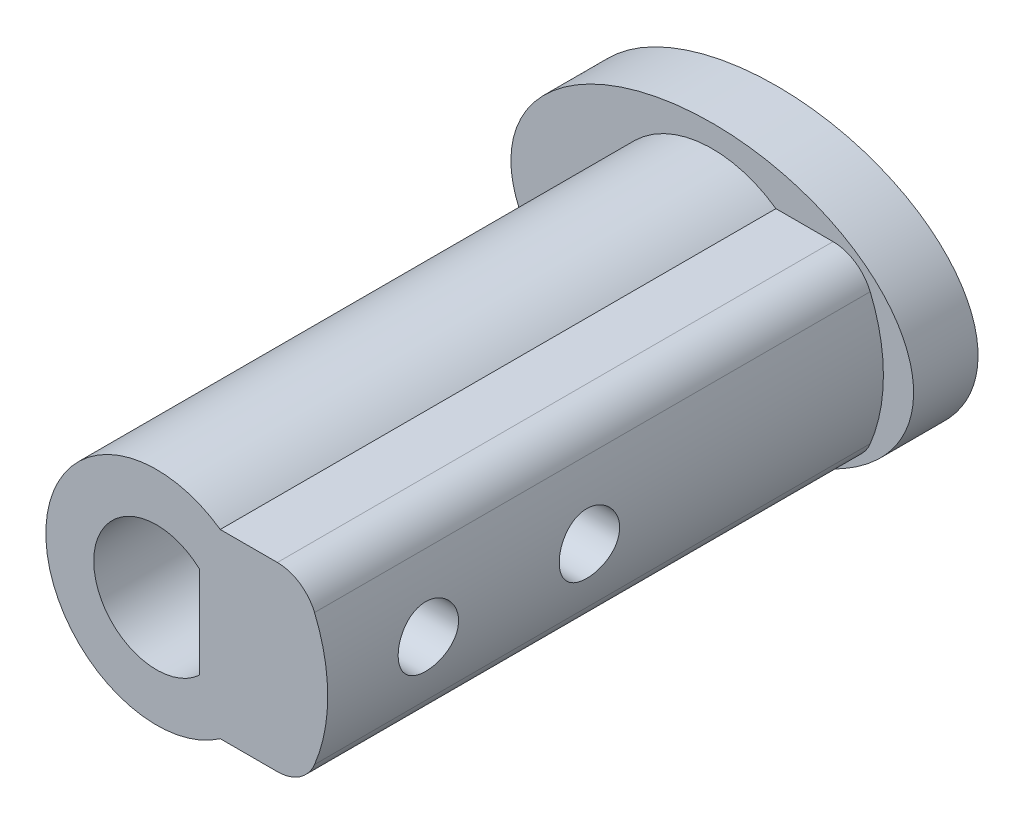
ISO-10303-21;
HEADER;
FILE_DESCRIPTION(('STEP AP214'),'2;1');
FILE_NAME('part.step','',(''),(''),'','','');
FILE_SCHEMA(('AUTOMOTIVE_DESIGN { 1 0 10303 214 1 1 1 1 }'));
ENDSEC;
DATA;
#1=APPLICATION_CONTEXT('core data for automotive mechanical design processes');
#2=APPLICATION_PROTOCOL_DEFINITION('international standard','automotive_design',2000,#1);
#3=PRODUCT_CONTEXT('',#1,'mechanical');
#4=PRODUCT('Part','Part','',(#3));
#5=PRODUCT_RELATED_PRODUCT_CATEGORY('part','',(#4));
#6=PRODUCT_DEFINITION_FORMATION('','',#4);
#7=PRODUCT_DEFINITION_CONTEXT('part definition',#1,'design');
#8=PRODUCT_DEFINITION('design','',#6,#7);
#9=PRODUCT_DEFINITION_SHAPE('','',#8);
#10=(LENGTH_UNIT() NAMED_UNIT(*) SI_UNIT(.MILLI.,.METRE.));
#11=(NAMED_UNIT(*) PLANE_ANGLE_UNIT() SI_UNIT($,.RADIAN.));
#12=(NAMED_UNIT(*) SI_UNIT($,.STERADIAN.) SOLID_ANGLE_UNIT());
#13=UNCERTAINTY_MEASURE_WITH_UNIT(LENGTH_MEASURE(1.E-05),#10,'distance_accuracy_value','');
#14=(GEOMETRIC_REPRESENTATION_CONTEXT(3) GLOBAL_UNCERTAINTY_ASSIGNED_CONTEXT((#13)) GLOBAL_UNIT_ASSIGNED_CONTEXT((#10,
#11,#12)) REPRESENTATION_CONTEXT('',''));
#15=CARTESIAN_POINT('',(0.,0.,0.));
#16=DIRECTION('',(0.,0.,1.));
#17=DIRECTION('',(1.,0.,0.));
#18=AXIS2_PLACEMENT_3D('',#15,#16,#17);
#19=CARTESIAN_POINT('',(0.,0.,13.8));
#20=DIRECTION('',(0.,0.,1.));
#21=DIRECTION('',(1.,0.,0.));
#22=AXIS2_PLACEMENT_3D('',#19,#20,#21);
#23=PLANE('',#22);
#24=DIRECTION('',(0.,1.,0.));
#25=VECTOR('',#24,1.);
#26=CARTESIAN_POINT('',(1.06,1.14455231422596,13.8));
#27=LINE('',#26,#25);
#28=CARTESIAN_POINT('',(1.06,-1.14455231422596,13.8));
#29=VERTEX_POINT('',#28);
#30=CARTESIAN_POINT('',(1.06,1.14455231422596,13.8));
#31=VERTEX_POINT('',#30);
#32=EDGE_CURVE('E71',#29,#31,#27,.T.);
#33=ORIENTED_EDGE('',*,*,#32,.F.);
#34=CARTESIAN_POINT('',(0.,0.,13.8));
#35=DIRECTION('',(0.,0.,1.));
#36=DIRECTION('',(1.,0.,0.));
#37=AXIS2_PLACEMENT_3D('',#34,#35,#36);
#38=CIRCLE('',#37,1.56);
#39=EDGE_CURVE('E130',#31,#29,#38,.T.);
#40=ORIENTED_EDGE('',*,*,#39,.F.);
#41=EDGE_LOOP('',(#33,#40));
#42=FACE_BOUND('',#41,.T.);
#43=DIRECTION('',(-1.,0.,0.));
#44=VECTOR('',#43,1.);
#45=CARTESIAN_POINT('',(0.,-2.25,13.8));
#46=LINE('',#45,#44);
#47=CARTESIAN_POINT('',(3.,-2.25,13.8));
#48=VERTEX_POINT('',#47);
#49=CARTESIAN_POINT('',(1.58113883008419,-2.25,13.8));
#50=VERTEX_POINT('',#49);
#51=EDGE_CURVE('E252',#48,#50,#46,.T.);
#52=ORIENTED_EDGE('',*,*,#51,.F.);
#53=CARTESIAN_POINT('',(3.,-1.25,13.8));
#54=DIRECTION('',(0.,0.,1.));
#55=DIRECTION('',(1.,0.,0.));
#56=AXIS2_PLACEMENT_3D('',#53,#54,#55);
#57=CIRCLE('',#56,1.);
#58=CARTESIAN_POINT('',(3.92307692307692,-1.63461538461538,13.8));
#59=VERTEX_POINT('',#58);
#60=EDGE_CURVE('E228',#48,#59,#57,.T.);
#61=ORIENTED_EDGE('',*,*,#60,.T.);
#62=CARTESIAN_POINT('',(0.,0.,13.8));
#63=DIRECTION('',(0.,0.,1.));
#64=DIRECTION('',(1.,0.,0.));
#65=AXIS2_PLACEMENT_3D('',#62,#63,#64);
#66=CIRCLE('',#65,4.25);
#67=CARTESIAN_POINT('',(3.92307692307692,1.63461538461538,13.8));
#68=VERTEX_POINT('',#67);
#69=EDGE_CURVE('E179',#59,#68,#66,.T.);
#70=ORIENTED_EDGE('',*,*,#69,.T.);
#71=CARTESIAN_POINT('',(3.,1.25,13.8));
#72=DIRECTION('',(0.,0.,1.));
#73=DIRECTION('',(1.,0.,0.));
#74=AXIS2_PLACEMENT_3D('',#71,#72,#73);
#75=CIRCLE('',#74,1.);
#76=CARTESIAN_POINT('',(3.,2.25,13.8));
#77=VERTEX_POINT('',#76);
#78=EDGE_CURVE('E229',#68,#77,#75,.T.);
#79=ORIENTED_EDGE('',*,*,#78,.T.);
#80=DIRECTION('',(-1.,0.,0.));
#81=VECTOR('',#80,1.);
#82=CARTESIAN_POINT('',(0.,2.25,13.8));
#83=LINE('',#82,#81);
#84=CARTESIAN_POINT('',(1.58113883008419,2.25,13.8));
#85=VERTEX_POINT('',#84);
#86=EDGE_CURVE('E262',#77,#85,#83,.T.);
#87=ORIENTED_EDGE('',*,*,#86,.T.);
#88=CARTESIAN_POINT('',(0.,0.,13.8));
#89=DIRECTION('',(0.,0.,1.));
#90=DIRECTION('',(1.,0.,0.));
#91=AXIS2_PLACEMENT_3D('',#88,#89,#90);
#92=CIRCLE('',#91,2.75);
#93=EDGE_CURVE('E246',#85,#50,#92,.T.);
#94=ORIENTED_EDGE('',*,*,#93,.T.);
#95=EDGE_LOOP('',(#52,#61,#70,#79,#87,#94));
#96=FACE_BOUND('',#95,.T.);
#97=ADVANCED_FACE('F55',(#42,#96),#23,.T.);
#98=CARTESIAN_POINT('',(0.,2.25,13.8));
#99=DIRECTION('',(0.,-1.,0.));
#100=DIRECTION('',(0.,0.,-1.));
#101=AXIS2_PLACEMENT_3D('',#98,#99,#100);
#102=PLANE('',#101);
#103=ORIENTED_EDGE('',*,*,#86,.F.);
#104=DIRECTION('',(0.,0.,-1.));
#105=VECTOR('',#104,1.);
#106=CARTESIAN_POINT('',(3.,2.25,13.8));
#107=LINE('',#106,#105);
#108=CARTESIAN_POINT('',(3.,2.25,0.));
#109=VERTEX_POINT('',#108);
#110=EDGE_CURVE('E238',#77,#109,#107,.T.);
#111=ORIENTED_EDGE('',*,*,#110,.T.);
#112=DIRECTION('',(-1.,0.,0.));
#113=VECTOR('',#112,1.);
#114=CARTESIAN_POINT('',(0.,2.25,0.));
#115=LINE('',#114,#113);
#116=CARTESIAN_POINT('',(1.58113883008419,2.25,0.));
#117=VERTEX_POINT('',#116);
#118=EDGE_CURVE('E224',#109,#117,#115,.T.);
#119=ORIENTED_EDGE('',*,*,#118,.T.);
#120=DIRECTION('',(0.,0.,-1.));
#121=VECTOR('',#120,1.);
#122=CARTESIAN_POINT('',(1.58113883008419,2.25,13.8));
#123=LINE('',#122,#121);
#124=EDGE_CURVE('E255',#85,#117,#123,.T.);
#125=ORIENTED_EDGE('',*,*,#124,.F.);
#126=EDGE_LOOP('',(#103,#111,#119,#125));
#127=FACE_BOUND('',#126,.T.);
#128=ADVANCED_FACE('F189',(#127),#102,.F.);
#129=CARTESIAN_POINT('',(0.,-2.25,13.8));
#130=DIRECTION('',(0.,-1.,0.));
#131=DIRECTION('',(0.,0.,-1.));
#132=AXIS2_PLACEMENT_3D('',#129,#130,#131);
#133=PLANE('',#132);
#134=DIRECTION('',(-1.,0.,0.));
#135=VECTOR('',#134,1.);
#136=CARTESIAN_POINT('',(0.,-2.25,0.));
#137=LINE('',#136,#135);
#138=CARTESIAN_POINT('',(3.,-2.25,0.));
#139=VERTEX_POINT('',#138);
#140=CARTESIAN_POINT('',(1.58113883008419,-2.25,0.));
#141=VERTEX_POINT('',#140);
#142=EDGE_CURVE('E216',#139,#141,#137,.T.);
#143=ORIENTED_EDGE('',*,*,#142,.F.);
#144=DIRECTION('',(0.,0.,1.));
#145=VECTOR('',#144,1.);
#146=CARTESIAN_POINT('',(3.,-2.25,13.8));
#147=LINE('',#146,#145);
#148=EDGE_CURVE('E218',#139,#48,#147,.T.);
#149=ORIENTED_EDGE('',*,*,#148,.T.);
#150=ORIENTED_EDGE('',*,*,#51,.T.);
#151=DIRECTION('',(0.,0.,-1.));
#152=VECTOR('',#151,1.);
#153=CARTESIAN_POINT('',(1.58113883008419,-2.25,13.8));
#154=LINE('',#153,#152);
#155=EDGE_CURVE('E221',#50,#141,#154,.T.);
#156=ORIENTED_EDGE('',*,*,#155,.T.);
#157=EDGE_LOOP('',(#143,#149,#150,#156));
#158=FACE_BOUND('',#157,.T.);
#159=ADVANCED_FACE('F187',(#158),#133,.T.);
#160=CARTESIAN_POINT('',(0.,0.,13.8));
#161=DIRECTION('',(0.,0.,-1.));
#162=DIRECTION('',(-1.,0.,0.));
#163=AXIS2_PLACEMENT_3D('',#160,#161,#162);
#164=CYLINDRICAL_SURFACE('',#163,4.25);
#165=CARTESIAN_POINT('',(4.25,0.,10.55));
#166=CARTESIAN_POINT('',(4.24999926232906,-0.0417801036558417,10.5500016410655));
#167=CARTESIAN_POINT('',(4.24937752218848,-0.0835820854495831,10.5535029499502));
#168=CARTESIAN_POINT('',(4.24695717273913,-0.16601110233646,10.5674083965709));
#169=CARTESIAN_POINT('',(4.24515752183303,-0.206637064271769,10.5778186438239));
#170=CARTESIAN_POINT('',(4.2405829590259,-0.28550975502663,10.6052157566467));
#171=CARTESIAN_POINT('',(4.23780888317352,-0.323758490481054,10.6221969856328));
#172=CARTESIAN_POINT('',(4.23158953081535,-0.39685965027986,10.6622386886377));
#173=CARTESIAN_POINT('',(4.22814432077395,-0.431712410425308,10.6852985607503));
#174=CARTESIAN_POINT('',(4.22092278237271,-0.497408258274775,10.7371043354236));
#175=CARTESIAN_POINT('',(4.21714360614304,-0.528209876681436,10.7659024345124));
#176=CARTESIAN_POINT('',(4.20970156508019,-0.584570632531849,10.8282548648953));
#177=CARTESIAN_POINT('',(4.2060387080512,-0.610129418843638,10.8618095144991));
#178=CARTESIAN_POINT('',(4.19921641337439,-0.655448076121172,10.9330111973356));
#179=CARTESIAN_POINT('',(4.19606065244577,-0.675166398644268,10.9706850585941));
#180=CARTESIAN_POINT('',(4.19064966689049,-0.707978576351588,11.0488754715234));
#181=CARTESIAN_POINT('',(4.18839437382125,-0.721072935029005,11.0893918068686));
#182=CARTESIAN_POINT('',(4.18506818060967,-0.740133703294526,11.1716755284485));
#183=CARTESIAN_POINT('',(4.18398533611756,-0.746172047357436,11.2134257591264));
#184=CARTESIAN_POINT('',(4.18309057064614,-0.75117252743079,11.2973597555259));
#185=CARTESIAN_POINT('',(4.18327854881353,-0.75013522496901,11.3395434865793));
#186=CARTESIAN_POINT('',(4.18489329766313,-0.741072329396011,11.422630066272));
#187=CARTESIAN_POINT('',(4.18630566365241,-0.733127993089627,11.4635420991887));
#188=CARTESIAN_POINT('',(4.19018746722882,-0.710604264366118,11.543443365905));
#189=CARTESIAN_POINT('',(4.19265694505036,-0.696024619403205,11.5824325264558));
#190=CARTESIAN_POINT('',(4.19839005614253,-0.66056309072688,11.6576220301013));
#191=CARTESIAN_POINT('',(4.20165786944088,-0.639647891501165,11.6938063287921));
#192=CARTESIAN_POINT('',(4.20861661439201,-0.592132570812258,11.762182510342));
#193=CARTESIAN_POINT('',(4.21230758420846,-0.565531936403415,11.7943740325544));
#194=CARTESIAN_POINT('',(4.21975981830548,-0.506960222014234,11.8543208232901));
#195=CARTESIAN_POINT('',(4.2235213457719,-0.474919521613591,11.8820080806479));
#196=CARTESIAN_POINT('',(4.23064348840692,-0.40661150852387,11.9316240888768));
#197=CARTESIAN_POINT('',(4.23400410037794,-0.370344162128984,11.9535527938213));
#198=CARTESIAN_POINT('',(4.23995141707324,-0.29454521674882,11.9910371493343));
#199=CARTESIAN_POINT('',(4.24253733251073,-0.255010340648913,12.0065863061233));
#200=CARTESIAN_POINT('',(4.24663767600577,-0.173834241190264,12.0308044983209));
#201=CARTESIAN_POINT('',(4.24815220470439,-0.132193216067157,12.0394741799646));
#202=CARTESIAN_POINT('',(4.24992546288406,-0.0485725558095839,12.0495939992918));
#203=CARTESIAN_POINT('',(4.25020041716811,-0.00660454218075324,12.051137419203));
#204=CARTESIAN_POINT('',(4.24950815832121,0.0769901356257715,12.0472102935282));
#205=CARTESIAN_POINT('',(4.24854099899416,0.118616814510258,12.041740051749));
#206=CARTESIAN_POINT('',(4.24548325347931,0.200055524270153,12.0240184613299));
#207=CARTESIAN_POINT('',(4.24340039830497,0.239878021478904,12.0118137605856));
#208=CARTESIAN_POINT('',(4.23834383527136,0.316911666540892,11.9810197697941));
#209=CARTESIAN_POINT('',(4.23537007247744,0.354122653189888,11.9624300860292));
#210=CARTESIAN_POINT('',(4.22882116347154,0.425278959676642,11.9191834639318));
#211=CARTESIAN_POINT('',(4.22524040769843,0.459188690438286,11.8944688350162));
#212=CARTESIAN_POINT('',(4.21789043127108,0.522412876883492,11.83975264383));
#213=CARTESIAN_POINT('',(4.21412119517438,0.551726955222171,11.8097506478476));
#214=CARTESIAN_POINT('',(4.20676598389818,0.605277478758793,11.7448911555741));
#215=CARTESIAN_POINT('',(4.20318266418919,0.629450601649747,11.7099810281203));
#216=CARTESIAN_POINT('',(4.19665631142218,0.671589438245797,11.6365407830835));
#217=CARTESIAN_POINT('',(4.19371325636983,0.689555365192545,11.5980107899151));
#218=CARTESIAN_POINT('',(4.18882100286901,0.718677351182494,11.5185941409196));
#219=CARTESIAN_POINT('',(4.18686737764035,0.729863787189205,11.4777189095037));
#220=CARTESIAN_POINT('',(4.18416451565379,0.745204023492612,11.3946318826126));
#221=CARTESIAN_POINT('',(4.1834151601336,0.749358517265351,11.3524202193518));
#222=CARTESIAN_POINT('',(4.18321121922775,0.750495820755532,11.2684917376012));
#223=CARTESIAN_POINT('',(4.18373862278374,0.74757839230588,11.2267762815984));
#224=CARTESIAN_POINT('',(4.18598908972288,0.734871614368317,11.144440026429));
#225=CARTESIAN_POINT('',(4.18771214781508,0.725082295289569,11.1038192224191));
#226=CARTESIAN_POINT('',(4.19215259279266,0.698949633335143,11.0248708272738));
#227=CARTESIAN_POINT('',(4.19486852210688,0.682615894548754,10.9865399698953));
#228=CARTESIAN_POINT('',(4.2009899182803,0.64386857614485,10.913146565259));
#229=CARTESIAN_POINT('',(4.20439542604978,0.621454635783343,10.8780842120906));
#230=CARTESIAN_POINT('',(4.2115688260778,0.570831308323749,10.8117210117007));
#231=CARTESIAN_POINT('',(4.21534093189969,0.542548878313247,10.7804763299391));
#232=CARTESIAN_POINT('',(4.22278986653214,0.481144741699562,10.7231426357581));
#233=CARTESIAN_POINT('',(4.2264666732178,0.448021922979752,10.6970548114159));
#234=CARTESIAN_POINT('',(4.23334435655226,0.377567199324346,10.650586328036));
#235=CARTESIAN_POINT('',(4.23654127457447,0.340204321815142,10.6302520320145));
#236=CARTESIAN_POINT('',(4.24206044179995,0.262550145066849,10.5961806933688));
#237=CARTESIAN_POINT('',(4.24438353917235,0.222261731048774,10.5824372497884));
#238=CARTESIAN_POINT('',(4.24740147616006,0.151527970272479,10.5648334543557));
#239=CARTESIAN_POINT('',(4.2483705808961,0.121504265501447,10.559280086802));
#240=CARTESIAN_POINT('',(4.24967010546265,0.0609909207886144,10.5518627988371));
#241=CARTESIAN_POINT('',(4.25000053853183,0.0305012905179232,10.5499988019509));
#242=CARTESIAN_POINT('',(4.25,0.,10.55));
#243=B_SPLINE_CURVE_WITH_KNOTS('',3,(#165,#166,#167,#168,#169,#170,#171,#172,#173,#174,#175,
#176,#177,#178,#179,#180,#181,#182,#183,#184,#185,#186,#187,#188,#189,#190,#191,#192,#193,#194,
#195,#196,#197,#198,#199,#200,#201,#202,#203,#204,#205,#206,#207,#208,#209,#210,#211,#212,#213,
#214,#215,#216,#217,#218,#219,#220,#221,#222,#223,#224,#225,#226,#227,#228,#229,#230,#231,#232,
#233,#234,#235,#236,#237,#238,#239,#240,#241,#242),.UNSPECIFIED.,.T.,.F.,(4,2,2,2,2,2,2,2,2,2,2,
2,2,2,2,2,2,2,2,2,2,2,2,2,2,2,2,2,2,2,2,2,2,2,2,2,2,2,4),(0.,0.125228795632619,
0.250568477870663,0.375800881310456,0.501020888917449,0.627436701173604,0.753860977204517,
0.881164136709624,1.00845761833749,1.13444172585883,1.26041583531821,1.38492769201763,
1.50944428814618,1.63462736898626,1.75982174874027,1.8867593244378,2.01369791248091,
2.14076539339061,2.26782093658993,2.39320852686428,2.51859068598222,2.64311506295635,
2.76764711986626,2.89339995869702,3.01916311757835,3.14639554927612,3.27362360960354,
3.40027729936533,3.52691849806632,3.65178362296406,3.77664819531808,3.90133019323914,
4.02601959027724,4.15236563621662,4.27874075690808,4.40610697542581,4.53334924564149,
4.62477360126061,4.71619606177588),.UNSPECIFIED.);
#244=CARTESIAN_POINT('',(4.25,0.,10.55));
#245=VERTEX_POINT('',#244);
#246=EDGE_CURVE('E168',#245,#245,#243,.T.);
#247=ORIENTED_EDGE('',*,*,#246,.T.);
#248=EDGE_LOOP('',(#247));
#249=FACE_BOUND('',#248,.T.);
#250=CARTESIAN_POINT('',(4.25,0.,6.55));
#251=CARTESIAN_POINT('',(4.24999926232906,-0.0417801036558417,6.55000164106545));
#252=CARTESIAN_POINT('',(4.24937752218848,-0.083582085449583,6.55350294995021));
#253=CARTESIAN_POINT('',(4.24695717273913,-0.16601110233646,6.56740839657088));
#254=CARTESIAN_POINT('',(4.24515752183303,-0.206637064271769,6.57781864382395));
#255=CARTESIAN_POINT('',(4.2405829590259,-0.28550975502663,6.60521575664666));
#256=CARTESIAN_POINT('',(4.23780888317352,-0.323758490481054,6.62219698563282));
#257=CARTESIAN_POINT('',(4.23158953081535,-0.39685965027986,6.66223868863767));
#258=CARTESIAN_POINT('',(4.22814432077395,-0.431712410425308,6.68529856075031));
#259=CARTESIAN_POINT('',(4.22092278237271,-0.497408258274774,6.73710433542363));
#260=CARTESIAN_POINT('',(4.21714360614304,-0.528209876681435,6.76590243451238));
#261=CARTESIAN_POINT('',(4.20970156508019,-0.584570632531849,6.82825486489534));
#262=CARTESIAN_POINT('',(4.2060387080512,-0.610129418843638,6.86180951449909));
#263=CARTESIAN_POINT('',(4.19921641337439,-0.655448076121171,6.93301119733562));
#264=CARTESIAN_POINT('',(4.19606065244577,-0.675166398644267,6.97068505859406));
#265=CARTESIAN_POINT('',(4.19064966689049,-0.707978576351586,7.04887547152335));
#266=CARTESIAN_POINT('',(4.18839437382125,-0.721072935029004,7.08939180686864));
#267=CARTESIAN_POINT('',(4.18506818060967,-0.740133703294525,7.17167552844854));
#268=CARTESIAN_POINT('',(4.18398533611756,-0.746172047357434,7.21342575912645));
#269=CARTESIAN_POINT('',(4.18309057064614,-0.751172527430789,7.29735975552588));
#270=CARTESIAN_POINT('',(4.18327854881353,-0.750135224969008,7.33954348657926));
#271=CARTESIAN_POINT('',(4.18489329766313,-0.74107232939601,7.42263006627202));
#272=CARTESIAN_POINT('',(4.18630566365241,-0.733127993089627,7.46354209918867));
#273=CARTESIAN_POINT('',(4.19018746722882,-0.710604264366117,7.54344336590499));
#274=CARTESIAN_POINT('',(4.19265694505036,-0.696024619403204,7.58243252645582));
#275=CARTESIAN_POINT('',(4.19839005614253,-0.660563090726879,7.65762203010133));
#276=CARTESIAN_POINT('',(4.20165786944088,-0.639647891501163,7.69380632879214));
#277=CARTESIAN_POINT('',(4.20861661439201,-0.592132570812257,7.762182510342));
#278=CARTESIAN_POINT('',(4.21230758420846,-0.565531936403414,7.79437403255435));
#279=CARTESIAN_POINT('',(4.21975981830548,-0.506960222014233,7.85432082329008));
#280=CARTESIAN_POINT('',(4.2235213457719,-0.47491952161359,7.88200808064788));
#281=CARTESIAN_POINT('',(4.23064348840692,-0.406611508523869,7.93162408887682));
#282=CARTESIAN_POINT('',(4.23400410037794,-0.370344162128984,7.95355279382128));
#283=CARTESIAN_POINT('',(4.23995141707324,-0.294545216748819,7.99103714933434));
#284=CARTESIAN_POINT('',(4.24253733251073,-0.255010340648912,8.00658630612332));
#285=CARTESIAN_POINT('',(4.24663767600577,-0.173834241190264,8.03080449832094));
#286=CARTESIAN_POINT('',(4.24815220470439,-0.132193216067158,8.03947417996462));
#287=CARTESIAN_POINT('',(4.24992546288406,-0.0485725558095844,8.04959399929182));
#288=CARTESIAN_POINT('',(4.25020041716811,-0.00660454218075368,8.05113741920298));
#289=CARTESIAN_POINT('',(4.24950815832121,0.0769901356257712,8.04721029352824));
#290=CARTESIAN_POINT('',(4.24854099899416,0.118616814510258,8.04174005174896));
#291=CARTESIAN_POINT('',(4.24548325347931,0.200055524270153,8.02401846132994));
#292=CARTESIAN_POINT('',(4.24340039830497,0.239878021478904,8.01181376058558));
#293=CARTESIAN_POINT('',(4.23834383527136,0.316911666540891,7.9810197697941));
#294=CARTESIAN_POINT('',(4.23537007247744,0.354122653189888,7.96243008602924));
#295=CARTESIAN_POINT('',(4.22882116347154,0.425278959676643,7.91918346393175));
#296=CARTESIAN_POINT('',(4.22524040769843,0.459188690438286,7.89446883501617));
#297=CARTESIAN_POINT('',(4.21789043127108,0.522412876883492,7.83975264382997));
#298=CARTESIAN_POINT('',(4.21412119517438,0.551726955222171,7.80975064784757));
#299=CARTESIAN_POINT('',(4.20676598389818,0.605277478758792,7.74489115557414));
#300=CARTESIAN_POINT('',(4.20318266418919,0.629450601649746,7.70998102812031));
#301=CARTESIAN_POINT('',(4.19665631142218,0.671589438245796,7.63654078308354));
#302=CARTESIAN_POINT('',(4.19371325636983,0.689555365192544,7.59801078991513));
#303=CARTESIAN_POINT('',(4.18882100286901,0.718677351182493,7.51859414091957));
#304=CARTESIAN_POINT('',(4.18686737764035,0.729863787189204,7.47771890950373));
#305=CARTESIAN_POINT('',(4.18416451565379,0.745204023492612,7.39463188261258));
#306=CARTESIAN_POINT('',(4.1834151601336,0.74935851726535,7.35242021935179));
#307=CARTESIAN_POINT('',(4.18321121922775,0.750495820755531,7.26849173760115));
#308=CARTESIAN_POINT('',(4.18373862278374,0.747578392305879,7.22677628159839));
#309=CARTESIAN_POINT('',(4.18598908972288,0.734871614368316,7.14444002642897));
#310=CARTESIAN_POINT('',(4.18771214781508,0.725082295289568,7.10381922241913));
#311=CARTESIAN_POINT('',(4.19215259279266,0.698949633335142,7.02487082727384));
#312=CARTESIAN_POINT('',(4.19486852210689,0.682615894548753,6.98653996989528));
#313=CARTESIAN_POINT('',(4.2009899182803,0.64386857614485,6.91314656525901));
#314=CARTESIAN_POINT('',(4.20439542604978,0.621454635783343,6.87808421209058));
#315=CARTESIAN_POINT('',(4.2115688260778,0.570831308323749,6.81172101170074));
#316=CARTESIAN_POINT('',(4.21534093189969,0.542548878313247,6.78047632993915));
#317=CARTESIAN_POINT('',(4.22278986653214,0.481144741699561,6.72314263575812));
#318=CARTESIAN_POINT('',(4.22646667321781,0.448021922979751,6.69705481141588));
#319=CARTESIAN_POINT('',(4.23334435655226,0.377567199324345,6.65058632803605));
#320=CARTESIAN_POINT('',(4.23654127457447,0.340204321815141,6.63025203201454));
#321=CARTESIAN_POINT('',(4.24206044179995,0.262550145066849,6.59618069336885));
#322=CARTESIAN_POINT('',(4.24438353917235,0.222261731048773,6.58243724978842));
#323=CARTESIAN_POINT('',(4.24740147616006,0.151527970272478,6.56483345435568));
#324=CARTESIAN_POINT('',(4.2483705808961,0.121504265501446,6.55928008680204));
#325=CARTESIAN_POINT('',(4.24967010546265,0.0609909207886137,6.55186279883711));
#326=CARTESIAN_POINT('',(4.25000053853183,0.0305012905179228,6.54999880195094));
#327=CARTESIAN_POINT('',(4.25,0.,6.55));
#328=B_SPLINE_CURVE_WITH_KNOTS('',3,(#250,#251,#252,#253,#254,#255,#256,#257,#258,#259,#260,
#261,#262,#263,#264,#265,#266,#267,#268,#269,#270,#271,#272,#273,#274,#275,#276,#277,#278,#279,
#280,#281,#282,#283,#284,#285,#286,#287,#288,#289,#290,#291,#292,#293,#294,#295,#296,#297,#298,
#299,#300,#301,#302,#303,#304,#305,#306,#307,#308,#309,#310,#311,#312,#313,#314,#315,#316,#317,
#318,#319,#320,#321,#322,#323,#324,#325,#326,#327),.UNSPECIFIED.,.T.,.F.,(4,2,2,2,2,2,2,2,2,2,2,
2,2,2,2,2,2,2,2,2,2,2,2,2,2,2,2,2,2,2,2,2,2,2,2,2,2,2,4),(0.,0.125228795632619,
0.250568477870662,0.375800881310456,0.501020888917449,0.627436701173603,0.753860977204518,
0.881164136709621,1.00845761833749,1.13444172585883,1.26041583531821,1.38492769201763,
1.50944428814618,1.63462736898626,1.75982174874027,1.8867593244378,2.0136979124809,
2.14076539339061,2.26782093658992,2.39320852686427,2.51859068598222,2.64311506295635,
2.76764711986626,2.89339995869702,3.01916311757835,3.14639554927611,3.27362360960354,
3.40027729936533,3.52691849806632,3.65178362296406,3.77664819531808,3.90133019323913,
4.02601959027723,4.15236563621661,4.27874075690808,4.4061069754258,4.53334924564149,
4.62477360126061,4.71619606177588),.UNSPECIFIED.);
#329=CARTESIAN_POINT('',(4.25,0.,6.55));
#330=VERTEX_POINT('',#329);
#331=EDGE_CURVE('E148',#330,#330,#328,.T.);
#332=ORIENTED_EDGE('',*,*,#331,.T.);
#333=EDGE_LOOP('',(#332));
#334=FACE_BOUND('',#333,.T.);
#335=ORIENTED_EDGE('',*,*,#69,.F.);
#336=DIRECTION('',(0.,0.,-1.));
#337=VECTOR('',#336,1.);
#338=CARTESIAN_POINT('',(3.92307692307692,-1.63461538461538,13.8));
#339=LINE('',#338,#337);
#340=CARTESIAN_POINT('',(3.92307692307692,-1.63461538461538,0.));
#341=VERTEX_POINT('',#340);
#342=EDGE_CURVE('E230',#59,#341,#339,.T.);
#343=ORIENTED_EDGE('',*,*,#342,.T.);
#344=CARTESIAN_POINT('',(0.,0.,0.));
#345=DIRECTION('',(0.,0.,1.));
#346=DIRECTION('',(1.,0.,0.));
#347=AXIS2_PLACEMENT_3D('',#344,#345,#346);
#348=CIRCLE('',#347,4.25);
#349=CARTESIAN_POINT('',(3.92307692307692,1.63461538461538,0.));
#350=VERTEX_POINT('',#349);
#351=EDGE_CURVE('E243',#341,#350,#348,.T.);
#352=ORIENTED_EDGE('',*,*,#351,.T.);
#353=DIRECTION('',(0.,0.,-1.));
#354=VECTOR('',#353,1.);
#355=CARTESIAN_POINT('',(3.92307692307692,1.63461538461538,13.8));
#356=LINE('',#355,#354);
#357=EDGE_CURVE('E233',#350,#68,#356,.F.);
#358=ORIENTED_EDGE('',*,*,#357,.T.);
#359=EDGE_LOOP('',(#335,#343,#352,#358));
#360=FACE_BOUND('',#359,.T.);
#361=ADVANCED_FACE('F181',(#249,#334,#360),#164,.T.);
#362=CARTESIAN_POINT('',(0.,0.,13.8));
#363=DIRECTION('',(0.,0.,-1.));
#364=DIRECTION('',(-1.,0.,0.));
#365=AXIS2_PLACEMENT_3D('',#362,#363,#364);
#366=CYLINDRICAL_SURFACE('',#365,2.75);
#367=ORIENTED_EDGE('',*,*,#93,.F.);
#368=ORIENTED_EDGE('',*,*,#124,.T.);
#369=CARTESIAN_POINT('',(0.,0.,0.));
#370=DIRECTION('',(0.,0.,1.));
#371=DIRECTION('',(1.,0.,0.));
#372=AXIS2_PLACEMENT_3D('',#369,#370,#371);
#373=CIRCLE('',#372,2.75);
#374=EDGE_CURVE('E175',#117,#141,#373,.T.);
#375=ORIENTED_EDGE('',*,*,#374,.T.);
#376=ORIENTED_EDGE('',*,*,#155,.F.);
#377=EDGE_LOOP('',(#367,#368,#375,#376));
#378=FACE_BOUND('',#377,.T.);
#379=ADVANCED_FACE('F186',(#378),#366,.T.);
#380=CARTESIAN_POINT('',(-0.249999999999999,0.,7.3));
#381=DIRECTION('',(1.,0.,0.));
#382=DIRECTION('',(0.,0.,-1.));
#383=AXIS2_PLACEMENT_3D('',#380,#381,#382);
#384=CYLINDRICAL_SURFACE('',#383,0.749999999999999);
#385=CARTESIAN_POINT('',(1.06,0.,7.3));
#386=DIRECTION('',(1.,0.,0.));
#387=DIRECTION('',(0.,1.,0.));
#388=AXIS2_PLACEMENT_3D('',#385,#386,#387);
#389=CIRCLE('',#388,0.749999999999999);
#390=CARTESIAN_POINT('',(1.06,0.749999999999999,7.3));
#391=VERTEX_POINT('',#390);
#392=EDGE_CURVE('E140',#391,#391,#389,.F.);
#393=ORIENTED_EDGE('',*,*,#392,.T.);
#394=EDGE_LOOP('',(#393));
#395=FACE_BOUND('',#394,.T.);
#396=ORIENTED_EDGE('',*,*,#331,.F.);
#397=EDGE_LOOP('',(#396));
#398=FACE_BOUND('',#397,.T.);
#399=ADVANCED_FACE('F163',(#395,#398),#384,.F.);
#400=CARTESIAN_POINT('',(-0.249999999999999,0.,11.3));
#401=DIRECTION('',(1.,0.,0.));
#402=DIRECTION('',(0.,0.,-1.));
#403=AXIS2_PLACEMENT_3D('',#400,#401,#402);
#404=CYLINDRICAL_SURFACE('',#403,0.75);
#405=CARTESIAN_POINT('',(1.06,0.,11.3));
#406=DIRECTION('',(1.,0.,0.));
#407=DIRECTION('',(0.,1.,0.));
#408=AXIS2_PLACEMENT_3D('',#405,#406,#407);
#409=CIRCLE('',#408,0.75);
#410=CARTESIAN_POINT('',(1.06,0.75,11.3));
#411=VERTEX_POINT('',#410);
#412=EDGE_CURVE('E59',#411,#411,#409,.F.);
#413=ORIENTED_EDGE('',*,*,#412,.T.);
#414=EDGE_LOOP('',(#413));
#415=FACE_BOUND('',#414,.T.);
#416=ORIENTED_EDGE('',*,*,#246,.F.);
#417=EDGE_LOOP('',(#416));
#418=FACE_BOUND('',#417,.T.);
#419=ADVANCED_FACE('F156',(#415,#418),#404,.F.);
#420=CARTESIAN_POINT('',(0.,0.,-1.6));
#421=DIRECTION('',(0.,0.,-1.));
#422=DIRECTION('',(-1.,0.,0.));
#423=AXIS2_PLACEMENT_3D('',#420,#421,#422);
#424=ELLIPSE('',#423,5.,3.3);
#425=DIRECTION('',(0.,0.,1.));
#426=VECTOR('',#425,1.);
#427=SURFACE_OF_LINEAR_EXTRUSION('',#424,#426);
#428=CARTESIAN_POINT('',(-5.,0.,-1.6));
#429=VERTEX_POINT('',#428);
#430=EDGE_CURVE('E144',#429,#429,#424,.T.);
#431=ORIENTED_EDGE('',*,*,#430,.F.);
#432=EDGE_LOOP('',(#431));
#433=FACE_BOUND('',#432,.T.);
#434=CARTESIAN_POINT('',(0.,0.,0.));
#435=DIRECTION('',(0.,0.,-1.));
#436=DIRECTION('',(-1.,0.,0.));
#437=AXIS2_PLACEMENT_3D('',#434,#435,#436);
#438=ELLIPSE('',#437,5.,3.3);
#439=CARTESIAN_POINT('',(-5.,0.,0.));
#440=VERTEX_POINT('',#439);
#441=EDGE_CURVE('E143',#440,#440,#438,.T.);
#442=ORIENTED_EDGE('',*,*,#441,.T.);
#443=EDGE_LOOP('',(#442));
#444=FACE_BOUND('',#443,.T.);
#445=ADVANCED_FACE('F151',(#433,#444),#427,.F.);
#446=CARTESIAN_POINT('',(0.,0.,-1.6));
#447=DIRECTION('',(0.,0.,-1.));
#448=DIRECTION('',(-1.,0.,0.));
#449=AXIS2_PLACEMENT_3D('',#446,#447,#448);
#450=PLANE('',#449);
#451=ORIENTED_EDGE('',*,*,#430,.T.);
#452=EDGE_LOOP('',(#451));
#453=FACE_BOUND('',#452,.T.);
#454=ADVANCED_FACE('F155',(#453),#450,.T.);
#455=CARTESIAN_POINT('',(0.,0.,0.));
#456=DIRECTION('',(0.,0.,-1.));
#457=DIRECTION('',(-1.,0.,0.));
#458=AXIS2_PLACEMENT_3D('',#455,#456,#457);
#459=PLANE('',#458);
#460=ORIENTED_EDGE('',*,*,#351,.F.);
#461=CARTESIAN_POINT('',(3.,-1.25,0.));
#462=DIRECTION('',(0.,0.,-1.));
#463=DIRECTION('',(-1.,0.,0.));
#464=AXIS2_PLACEMENT_3D('',#461,#462,#463);
#465=CIRCLE('',#464,1.);
#466=EDGE_CURVE('E64',#341,#139,#465,.T.);
#467=ORIENTED_EDGE('',*,*,#466,.T.);
#468=ORIENTED_EDGE('',*,*,#142,.T.);
#469=ORIENTED_EDGE('',*,*,#374,.F.);
#470=ORIENTED_EDGE('',*,*,#118,.F.);
#471=CARTESIAN_POINT('',(3.,1.25,0.));
#472=DIRECTION('',(0.,0.,-1.));
#473=DIRECTION('',(-1.,0.,0.));
#474=AXIS2_PLACEMENT_3D('',#471,#472,#473);
#475=CIRCLE('',#474,1.);
#476=EDGE_CURVE('E12',#109,#350,#475,.T.);
#477=ORIENTED_EDGE('',*,*,#476,.T.);
#478=EDGE_LOOP('',(#460,#467,#468,#469,#470,#477));
#479=FACE_BOUND('',#478,.T.);
#480=ORIENTED_EDGE('',*,*,#441,.F.);
#481=EDGE_LOOP('',(#480));
#482=FACE_BOUND('',#481,.T.);
#483=ADVANCED_FACE('F158',(#479,#482),#459,.F.);
#484=CARTESIAN_POINT('',(3.,-1.25,13.8));
#485=DIRECTION('',(0.,0.,-1.));
#486=DIRECTION('',(-1.,0.,0.));
#487=AXIS2_PLACEMENT_3D('',#484,#485,#486);
#488=CYLINDRICAL_SURFACE('',#487,1.);
#489=ORIENTED_EDGE('',*,*,#60,.F.);
#490=ORIENTED_EDGE('',*,*,#148,.F.);
#491=ORIENTED_EDGE('',*,*,#466,.F.);
#492=ORIENTED_EDGE('',*,*,#342,.F.);
#493=EDGE_LOOP('',(#489,#490,#491,#492));
#494=FACE_BOUND('',#493,.T.);
#495=ADVANCED_FACE('F194',(#494),#488,.T.);
#496=CARTESIAN_POINT('',(3.,1.25,13.8));
#497=DIRECTION('',(0.,0.,-1.));
#498=DIRECTION('',(-1.,0.,0.));
#499=AXIS2_PLACEMENT_3D('',#496,#497,#498);
#500=CYLINDRICAL_SURFACE('',#499,1.);
#501=ORIENTED_EDGE('',*,*,#78,.F.);
#502=ORIENTED_EDGE('',*,*,#357,.F.);
#503=ORIENTED_EDGE('',*,*,#476,.F.);
#504=ORIENTED_EDGE('',*,*,#110,.F.);
#505=EDGE_LOOP('',(#501,#502,#503,#504));
#506=FACE_BOUND('',#505,.T.);
#507=ADVANCED_FACE('F57',(#506),#500,.T.);
#508=CARTESIAN_POINT('',(1.06,1.14455231422596,1.42583750937693));
#509=DIRECTION('',(1.,0.,0.));
#510=DIRECTION('',(0.,1.,0.));
#511=AXIS2_PLACEMENT_3D('',#508,#509,#510);
#512=PLANE('',#511);
#513=ORIENTED_EDGE('',*,*,#412,.F.);
#514=EDGE_LOOP('',(#513));
#515=FACE_BOUND('',#514,.T.);
#516=DIRECTION('',(0.,-1.,0.));
#517=VECTOR('',#516,1.);
#518=CARTESIAN_POINT('',(1.06,1.14455231422596,5.5));
#519=LINE('',#518,#517);
#520=CARTESIAN_POINT('',(1.06,1.14455231422596,5.5));
#521=VERTEX_POINT('',#520);
#522=CARTESIAN_POINT('',(1.06,-1.14455231422596,5.5));
#523=VERTEX_POINT('',#522);
#524=EDGE_CURVE('E124',#521,#523,#519,.T.);
#525=ORIENTED_EDGE('',*,*,#524,.T.);
#526=DIRECTION('',(0.,0.,1.));
#527=VECTOR('',#526,1.);
#528=CARTESIAN_POINT('',(1.06,-1.14455231422596,1.42583750937693));
#529=LINE('',#528,#527);
#530=EDGE_CURVE('E119',#523,#29,#529,.T.);
#531=ORIENTED_EDGE('',*,*,#530,.T.);
#532=ORIENTED_EDGE('',*,*,#32,.T.);
#533=DIRECTION('',(0.,0.,1.));
#534=VECTOR('',#533,1.);
#535=CARTESIAN_POINT('',(1.06,1.14455231422596,1.42583750937693));
#536=LINE('',#535,#534);
#537=EDGE_CURVE('E127',#521,#31,#536,.T.);
#538=ORIENTED_EDGE('',*,*,#537,.F.);
#539=EDGE_LOOP('',(#525,#531,#532,#538));
#540=FACE_BOUND('',#539,.T.);
#541=ORIENTED_EDGE('',*,*,#392,.F.);
#542=EDGE_LOOP('',(#541));
#543=FACE_BOUND('',#542,.T.);
#544=ADVANCED_FACE('F121',(#515,#540,#543),#512,.F.);
#545=CARTESIAN_POINT('',(0.,0.,1.42583750937693));
#546=DIRECTION('',(0.,0.,1.));
#547=DIRECTION('',(1.,0.,0.));
#548=AXIS2_PLACEMENT_3D('',#545,#546,#547);
#549=CYLINDRICAL_SURFACE('',#548,1.56);
#550=CARTESIAN_POINT('',(0.,0.,5.5));
#551=DIRECTION('',(0.,0.,1.));
#552=DIRECTION('',(1.,0.,0.));
#553=AXIS2_PLACEMENT_3D('',#550,#551,#552);
#554=CIRCLE('',#553,1.56);
#555=EDGE_CURVE('E138',#523,#521,#554,.F.);
#556=ORIENTED_EDGE('',*,*,#555,.T.);
#557=ORIENTED_EDGE('',*,*,#537,.T.);
#558=ORIENTED_EDGE('',*,*,#39,.T.);
#559=ORIENTED_EDGE('',*,*,#530,.F.);
#560=EDGE_LOOP('',(#556,#557,#558,#559));
#561=FACE_BOUND('',#560,.T.);
#562=ADVANCED_FACE('F131',(#561),#549,.F.);
#563=CARTESIAN_POINT('',(0.,0.,5.5));
#564=DIRECTION('',(0.,0.,1.));
#565=DIRECTION('',(1.,0.,0.));
#566=AXIS2_PLACEMENT_3D('',#563,#564,#565);
#567=PLANE('',#566);
#568=ORIENTED_EDGE('',*,*,#555,.F.);
#569=ORIENTED_EDGE('',*,*,#524,.F.);
#570=EDGE_LOOP('',(#568,#569));
#571=FACE_BOUND('',#570,.T.);
#572=ADVANCED_FACE('F209',(#571),#567,.T.);
#573=CLOSED_SHELL('',(#97,#128,#159,#361,#379,#399,#419,#445,#454,#483,#495,#507,#544,#562,#572));
#574=MANIFOLD_SOLID_BREP('B2',#573);
#575=ADVANCED_BREP_SHAPE_REPRESENTATION('',(#18,#574),#14);
#576=SHAPE_DEFINITION_REPRESENTATION(#9,#575);
ENDSEC;
END-ISO-10303-21;
